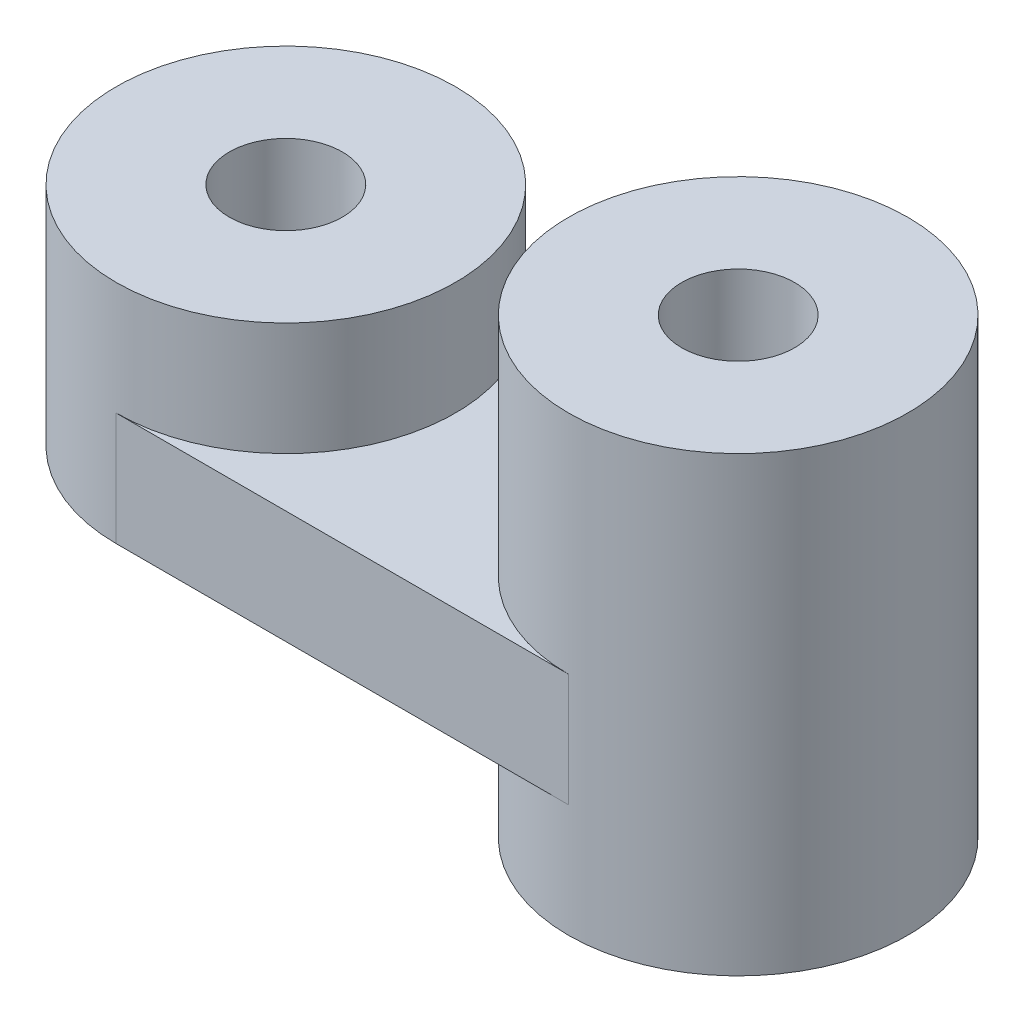
ISO-10303-21;
HEADER;
FILE_DESCRIPTION(('STEP AP214'),'2;1');
FILE_NAME('part.step','',(''),(''),'','','');
FILE_SCHEMA(('AUTOMOTIVE_DESIGN { 1 0 10303 214 1 1 1 1 }'));
ENDSEC;
DATA;
#1=APPLICATION_CONTEXT('core data for automotive mechanical design processes');
#2=APPLICATION_PROTOCOL_DEFINITION('international standard','automotive_design',2000,#1);
#3=PRODUCT_CONTEXT('',#1,'mechanical');
#4=PRODUCT('Part','Part','',(#3));
#5=PRODUCT_RELATED_PRODUCT_CATEGORY('part','',(#4));
#6=PRODUCT_DEFINITION_FORMATION('','',#4);
#7=PRODUCT_DEFINITION_CONTEXT('part definition',#1,'design');
#8=PRODUCT_DEFINITION('design','',#6,#7);
#9=PRODUCT_DEFINITION_SHAPE('','',#8);
#10=(LENGTH_UNIT() NAMED_UNIT(*) SI_UNIT(.MILLI.,.METRE.));
#11=(NAMED_UNIT(*) PLANE_ANGLE_UNIT() SI_UNIT($,.RADIAN.));
#12=(NAMED_UNIT(*) SI_UNIT($,.STERADIAN.) SOLID_ANGLE_UNIT());
#13=UNCERTAINTY_MEASURE_WITH_UNIT(LENGTH_MEASURE(1.E-05),#10,'distance_accuracy_value','');
#14=(GEOMETRIC_REPRESENTATION_CONTEXT(3) GLOBAL_UNCERTAINTY_ASSIGNED_CONTEXT((#13)) GLOBAL_UNIT_ASSIGNED_CONTEXT((#10,
#11,#12)) REPRESENTATION_CONTEXT('',''));
#15=CARTESIAN_POINT('',(0.,0.,0.));
#16=DIRECTION('',(0.,0.,1.));
#17=DIRECTION('',(1.,0.,0.));
#18=AXIS2_PLACEMENT_3D('',#15,#16,#17);
#19=CARTESIAN_POINT('',(-12.5,-5.,7.5));
#20=DIRECTION('',(0.,1.,0.));
#21=DIRECTION('',(0.,0.,1.));
#22=AXIS2_PLACEMENT_3D('',#19,#20,#21);
#23=CYLINDRICAL_SURFACE('',#22,2.5);
#24=CARTESIAN_POINT('',(-12.5,15.,7.5));
#25=DIRECTION('',(0.,1.,0.));
#26=DIRECTION('',(0.,0.,1.));
#27=AXIS2_PLACEMENT_3D('',#24,#25,#26);
#28=CIRCLE('',#27,2.5);
#29=CARTESIAN_POINT('',(-12.5,15.,10.));
#30=VERTEX_POINT('',#29);
#31=EDGE_CURVE('E206',#30,#30,#28,.T.);
#32=ORIENTED_EDGE('',*,*,#31,.T.);
#33=EDGE_LOOP('',(#32));
#34=FACE_BOUND('',#33,.T.);
#35=DIRECTION('',(0.,1.,0.));
#36=VECTOR('',#35,1.);
#37=CARTESIAN_POINT('',(-12.5,-5.,5.));
#38=LINE('',#37,#36);
#39=CARTESIAN_POINT('',(-12.5,10.,5.));
#40=VERTEX_POINT('',#39);
#41=CARTESIAN_POINT('',(-12.5,5.,5.));
#42=VERTEX_POINT('',#41);
#43=EDGE_CURVE('E81',#40,#42,#38,.F.);
#44=ORIENTED_EDGE('',*,*,#43,.F.);
#45=CARTESIAN_POINT('',(-12.5,10.,7.5));
#46=DIRECTION('',(0.,1.,0.));
#47=DIRECTION('',(0.,0.,1.));
#48=AXIS2_PLACEMENT_3D('',#45,#46,#47);
#49=CIRCLE('',#48,2.5);
#50=CARTESIAN_POINT('',(-12.5,10.,10.));
#51=VERTEX_POINT('',#50);
#52=EDGE_CURVE('E160',#40,#51,#49,.F.);
#53=ORIENTED_EDGE('',*,*,#52,.T.);
#54=DIRECTION('',(0.,1.,0.));
#55=VECTOR('',#54,1.);
#56=CARTESIAN_POINT('',(-12.5,-5.,10.));
#57=LINE('',#56,#55);
#58=CARTESIAN_POINT('',(-12.5,5.,10.));
#59=VERTEX_POINT('',#58);
#60=EDGE_CURVE('E89',#59,#51,#57,.T.);
#61=ORIENTED_EDGE('',*,*,#60,.F.);
#62=CARTESIAN_POINT('',(-12.5,5.,7.5));
#63=DIRECTION('',(0.,1.,0.));
#64=DIRECTION('',(0.,0.,1.));
#65=AXIS2_PLACEMENT_3D('',#62,#63,#64);
#66=CIRCLE('',#65,2.5);
#67=EDGE_CURVE('E213',#42,#59,#66,.T.);
#68=ORIENTED_EDGE('',*,*,#67,.F.);
#69=EDGE_LOOP('',(#44,#53,#61,#68));
#70=FACE_BOUND('',#69,.T.);
#71=ADVANCED_FACE('F65',(#34,#70),#23,.F.);
#72=CARTESIAN_POINT('',(7.5,0.,7.5));
#73=DIRECTION('',(0.,1.,0.));
#74=DIRECTION('',(0.,0.,1.));
#75=AXIS2_PLACEMENT_3D('',#72,#73,#74);
#76=CYLINDRICAL_SURFACE('',#75,2.5);
#77=CARTESIAN_POINT('',(7.5,20.,7.5));
#78=DIRECTION('',(0.,1.,0.));
#79=DIRECTION('',(0.,0.,1.));
#80=AXIS2_PLACEMENT_3D('',#77,#78,#79);
#81=CIRCLE('',#80,2.5);
#82=CARTESIAN_POINT('',(7.5,20.,10.));
#83=VERTEX_POINT('',#82);
#84=EDGE_CURVE('E159',#83,#83,#81,.T.);
#85=ORIENTED_EDGE('',*,*,#84,.T.);
#86=EDGE_LOOP('',(#85));
#87=FACE_BOUND('',#86,.T.);
#88=CARTESIAN_POINT('',(7.5,0.,7.5));
#89=DIRECTION('',(0.,1.,0.));
#90=DIRECTION('',(0.,0.,1.));
#91=AXIS2_PLACEMENT_3D('',#88,#89,#90);
#92=CIRCLE('',#91,2.5);
#93=CARTESIAN_POINT('',(7.5,0.,10.));
#94=VERTEX_POINT('',#93);
#95=EDGE_CURVE('E165',#94,#94,#92,.T.);
#96=ORIENTED_EDGE('',*,*,#95,.F.);
#97=EDGE_LOOP('',(#96));
#98=FACE_BOUND('',#97,.T.);
#99=DIRECTION('',(0.,1.,0.));
#100=VECTOR('',#99,1.);
#101=CARTESIAN_POINT('',(7.5,0.,10.));
#102=LINE('',#101,#100);
#103=CARTESIAN_POINT('',(7.5,5.,10.));
#104=VERTEX_POINT('',#103);
#105=CARTESIAN_POINT('',(7.5,10.,10.));
#106=VERTEX_POINT('',#105);
#107=EDGE_CURVE('E74',#104,#106,#102,.T.);
#108=ORIENTED_EDGE('',*,*,#107,.T.);
#109=CARTESIAN_POINT('',(7.5,10.,7.5));
#110=DIRECTION('',(0.,1.,0.));
#111=DIRECTION('',(0.,0.,1.));
#112=AXIS2_PLACEMENT_3D('',#109,#110,#111);
#113=CIRCLE('',#112,2.5);
#114=CARTESIAN_POINT('',(7.5,10.,5.));
#115=VERTEX_POINT('',#114);
#116=EDGE_CURVE('E167',#106,#115,#113,.F.);
#117=ORIENTED_EDGE('',*,*,#116,.T.);
#118=DIRECTION('',(0.,1.,0.));
#119=VECTOR('',#118,1.);
#120=CARTESIAN_POINT('',(7.5,0.,5.));
#121=LINE('',#120,#119);
#122=CARTESIAN_POINT('',(7.5,5.,5.));
#123=VERTEX_POINT('',#122);
#124=EDGE_CURVE('E228',#115,#123,#121,.F.);
#125=ORIENTED_EDGE('',*,*,#124,.T.);
#126=CARTESIAN_POINT('',(7.5,5.,7.5));
#127=DIRECTION('',(0.,1.,0.));
#128=DIRECTION('',(0.,0.,1.));
#129=AXIS2_PLACEMENT_3D('',#126,#127,#128);
#130=CIRCLE('',#129,2.5);
#131=EDGE_CURVE('E186',#123,#104,#130,.T.);
#132=ORIENTED_EDGE('',*,*,#131,.T.);
#133=EDGE_LOOP('',(#108,#117,#125,#132));
#134=FACE_BOUND('',#133,.T.);
#135=ADVANCED_FACE('F235',(#87,#98,#134),#76,.F.);
#136=CARTESIAN_POINT('',(7.5,20.,7.5));
#137=DIRECTION('',(0.,-1.,0.));
#138=DIRECTION('',(0.,0.,-1.));
#139=AXIS2_PLACEMENT_3D('',#136,#137,#138);
#140=CYLINDRICAL_SURFACE('',#139,7.5);
#141=CARTESIAN_POINT('',(7.5,0.,7.5));
#142=DIRECTION('',(0.,1.,0.));
#143=DIRECTION('',(0.,0.,1.));
#144=AXIS2_PLACEMENT_3D('',#141,#142,#143);
#145=CIRCLE('',#144,7.5);
#146=CARTESIAN_POINT('',(7.5,0.,15.));
#147=VERTEX_POINT('',#146);
#148=EDGE_CURVE('E173',#147,#147,#145,.T.);
#149=ORIENTED_EDGE('',*,*,#148,.T.);
#150=EDGE_LOOP('',(#149));
#151=FACE_BOUND('',#150,.T.);
#152=CARTESIAN_POINT('',(7.5,20.,7.5));
#153=DIRECTION('',(0.,1.,0.));
#154=DIRECTION('',(0.,0.,1.));
#155=AXIS2_PLACEMENT_3D('',#152,#153,#154);
#156=CIRCLE('',#155,7.5);
#157=CARTESIAN_POINT('',(7.5,20.,15.));
#158=VERTEX_POINT('',#157);
#159=EDGE_CURVE('E175',#158,#158,#156,.T.);
#160=ORIENTED_EDGE('',*,*,#159,.F.);
#161=EDGE_LOOP('',(#160));
#162=FACE_BOUND('',#161,.T.);
#163=DIRECTION('',(0.,-1.,0.));
#164=VECTOR('',#163,1.);
#165=CARTESIAN_POINT('',(7.5,7.5,0.));
#166=LINE('',#165,#164);
#167=CARTESIAN_POINT('',(7.5,10.,0.));
#168=VERTEX_POINT('',#167);
#169=CARTESIAN_POINT('',(7.5,5.,0.));
#170=VERTEX_POINT('',#169);
#171=EDGE_CURVE('E143',#168,#170,#166,.T.);
#172=ORIENTED_EDGE('',*,*,#171,.F.);
#173=CARTESIAN_POINT('',(7.5,10.,7.5));
#174=DIRECTION('',(0.,1.,0.));
#175=DIRECTION('',(0.,0.,1.));
#176=AXIS2_PLACEMENT_3D('',#173,#174,#175);
#177=CIRCLE('',#176,7.5);
#178=CARTESIAN_POINT('',(7.5,10.,15.));
#179=VERTEX_POINT('',#178);
#180=EDGE_CURVE('E12',#168,#179,#177,.T.);
#181=ORIENTED_EDGE('',*,*,#180,.T.);
#182=DIRECTION('',(0.,-1.,0.));
#183=VECTOR('',#182,1.);
#184=CARTESIAN_POINT('',(7.5,7.5,15.));
#185=LINE('',#184,#183);
#186=CARTESIAN_POINT('',(7.5,5.,15.));
#187=VERTEX_POINT('',#186);
#188=EDGE_CURVE('E197',#179,#187,#185,.T.);
#189=ORIENTED_EDGE('',*,*,#188,.T.);
#190=CARTESIAN_POINT('',(7.5,5.,7.5));
#191=DIRECTION('',(0.,1.,0.));
#192=DIRECTION('',(0.,0.,1.));
#193=AXIS2_PLACEMENT_3D('',#190,#191,#192);
#194=CIRCLE('',#193,7.5);
#195=EDGE_CURVE('E179',#187,#170,#194,.F.);
#196=ORIENTED_EDGE('',*,*,#195,.T.);
#197=EDGE_LOOP('',(#172,#181,#189,#196));
#198=FACE_BOUND('',#197,.T.);
#199=ADVANCED_FACE('F256',(#151,#162,#198),#140,.T.);
#200=CARTESIAN_POINT('',(-20.,5.,-5.));
#201=DIRECTION('',(0.,1.,0.));
#202=DIRECTION('',(0.,0.,1.));
#203=AXIS2_PLACEMENT_3D('',#200,#201,#202);
#204=PLANE('',#203);
#205=ORIENTED_EDGE('',*,*,#67,.T.);
#206=DIRECTION('',(0.,0.,1.));
#207=VECTOR('',#206,1.);
#208=CARTESIAN_POINT('',(-12.5,5.,0.));
#209=LINE('',#208,#207);
#210=EDGE_CURVE('E203',#42,#59,#209,.T.);
#211=ORIENTED_EDGE('',*,*,#210,.F.);
#212=EDGE_LOOP('',(#205,#211));
#213=FACE_BOUND('',#212,.T.);
#214=ORIENTED_EDGE('',*,*,#195,.F.);
#215=DIRECTION('',(1.,0.,0.));
#216=VECTOR('',#215,1.);
#217=CARTESIAN_POINT('',(-12.5,5.,15.));
#218=LINE('',#217,#216);
#219=CARTESIAN_POINT('',(-12.5,5.,15.));
#220=VERTEX_POINT('',#219);
#221=EDGE_CURVE('E190',#220,#187,#218,.T.);
#222=ORIENTED_EDGE('',*,*,#221,.F.);
#223=CARTESIAN_POINT('',(-12.5,5.,7.5));
#224=DIRECTION('',(0.,1.,0.));
#225=DIRECTION('',(0.,0.,1.));
#226=AXIS2_PLACEMENT_3D('',#223,#224,#225);
#227=CIRCLE('',#226,7.5);
#228=CARTESIAN_POINT('',(-12.5,5.,0.));
#229=VERTEX_POINT('',#228);
#230=EDGE_CURVE('E217',#229,#220,#227,.T.);
#231=ORIENTED_EDGE('',*,*,#230,.F.);
#232=DIRECTION('',(1.,0.,0.));
#233=VECTOR('',#232,1.);
#234=CARTESIAN_POINT('',(-12.5,5.,0.));
#235=LINE('',#234,#233);
#236=EDGE_CURVE('E137',#229,#170,#235,.T.);
#237=ORIENTED_EDGE('',*,*,#236,.T.);
#238=EDGE_LOOP('',(#214,#222,#231,#237));
#239=FACE_BOUND('',#238,.T.);
#240=ADVANCED_FACE('F259',(#213,#239),#204,.F.);
#241=CARTESIAN_POINT('',(-12.5,20.,7.5));
#242=DIRECTION('',(0.,-1.,0.));
#243=DIRECTION('',(0.,0.,-1.));
#244=AXIS2_PLACEMENT_3D('',#241,#242,#243);
#245=CYLINDRICAL_SURFACE('',#244,7.5);
#246=CARTESIAN_POINT('',(-12.5,15.,7.5));
#247=DIRECTION('',(0.,-1.,0.));
#248=DIRECTION('',(0.,0.,-1.));
#249=AXIS2_PLACEMENT_3D('',#246,#247,#248);
#250=CIRCLE('',#249,7.5);
#251=CARTESIAN_POINT('',(-12.5,15.,0.));
#252=VERTEX_POINT('',#251);
#253=EDGE_CURVE('E220',#252,#252,#250,.T.);
#254=ORIENTED_EDGE('',*,*,#253,.T.);
#255=EDGE_LOOP('',(#254));
#256=FACE_BOUND('',#255,.T.);
#257=CARTESIAN_POINT('',(-12.5,10.,7.5));
#258=DIRECTION('',(0.,1.,0.));
#259=DIRECTION('',(0.,0.,1.));
#260=AXIS2_PLACEMENT_3D('',#257,#258,#259);
#261=CIRCLE('',#260,7.5);
#262=CARTESIAN_POINT('',(-12.5,10.,15.));
#263=VERTEX_POINT('',#262);
#264=CARTESIAN_POINT('',(-12.5,10.,0.));
#265=VERTEX_POINT('',#264);
#266=EDGE_CURVE('E150',#263,#265,#261,.T.);
#267=ORIENTED_EDGE('',*,*,#266,.T.);
#268=DIRECTION('',(0.,1.,0.));
#269=VECTOR('',#268,1.);
#270=CARTESIAN_POINT('',(-12.5,5.,0.));
#271=LINE('',#270,#269);
#272=EDGE_CURVE('E132',#229,#265,#271,.T.);
#273=ORIENTED_EDGE('',*,*,#272,.F.);
#274=ORIENTED_EDGE('',*,*,#230,.T.);
#275=DIRECTION('',(0.,1.,0.));
#276=VECTOR('',#275,1.);
#277=CARTESIAN_POINT('',(-12.5,5.,15.));
#278=LINE('',#277,#276);
#279=EDGE_CURVE('E157',#220,#263,#278,.T.);
#280=ORIENTED_EDGE('',*,*,#279,.T.);
#281=EDGE_LOOP('',(#267,#273,#274,#280));
#282=FACE_BOUND('',#281,.T.);
#283=ADVANCED_FACE('F67',(#256,#282),#245,.T.);
#284=CARTESIAN_POINT('',(-20.,15.,-5.));
#285=DIRECTION('',(0.,-1.,0.));
#286=DIRECTION('',(0.,0.,-1.));
#287=AXIS2_PLACEMENT_3D('',#284,#285,#286);
#288=PLANE('',#287);
#289=ORIENTED_EDGE('',*,*,#31,.F.);
#290=EDGE_LOOP('',(#289));
#291=FACE_BOUND('',#290,.T.);
#292=ORIENTED_EDGE('',*,*,#253,.F.);
#293=EDGE_LOOP('',(#292));
#294=FACE_BOUND('',#293,.T.);
#295=ADVANCED_FACE('F267',(#291,#294),#288,.F.);
#296=CARTESIAN_POINT('',(-12.5,5.,0.));
#297=DIRECTION('',(1.,0.,0.));
#298=DIRECTION('',(0.,0.,-1.));
#299=AXIS2_PLACEMENT_3D('',#296,#297,#298);
#300=PLANE('',#299);
#301=ORIENTED_EDGE('',*,*,#60,.T.);
#302=DIRECTION('',(0.,0.,1.));
#303=VECTOR('',#302,1.);
#304=CARTESIAN_POINT('',(-12.5,10.,0.));
#305=LINE('',#304,#303);
#306=EDGE_CURVE('E153',#40,#51,#305,.T.);
#307=ORIENTED_EDGE('',*,*,#306,.F.);
#308=ORIENTED_EDGE('',*,*,#43,.T.);
#309=ORIENTED_EDGE('',*,*,#210,.T.);
#310=EDGE_LOOP('',(#301,#307,#308,#309));
#311=FACE_BOUND('',#310,.T.);
#312=ADVANCED_FACE('F285',(#311),#300,.F.);
#313=CARTESIAN_POINT('',(0.,0.,0.));
#314=DIRECTION('',(0.,0.,-1.));
#315=DIRECTION('',(-1.,0.,0.));
#316=AXIS2_PLACEMENT_3D('',#313,#314,#315);
#317=PLANE('',#316);
#318=ORIENTED_EDGE('',*,*,#236,.F.);
#319=ORIENTED_EDGE('',*,*,#272,.T.);
#320=DIRECTION('',(-1.,0.,0.));
#321=VECTOR('',#320,1.);
#322=CARTESIAN_POINT('',(7.5,10.,0.));
#323=LINE('',#322,#321);
#324=EDGE_CURVE('E135',#168,#265,#323,.T.);
#325=ORIENTED_EDGE('',*,*,#324,.F.);
#326=ORIENTED_EDGE('',*,*,#171,.T.);
#327=EDGE_LOOP('',(#318,#319,#325,#326));
#328=FACE_BOUND('',#327,.T.);
#329=ADVANCED_FACE('F134',(#328),#317,.T.);
#330=CARTESIAN_POINT('',(0.,0.,15.));
#331=DIRECTION('',(0.,0.,-1.));
#332=DIRECTION('',(-1.,0.,0.));
#333=AXIS2_PLACEMENT_3D('',#330,#331,#332);
#334=PLANE('',#333);
#335=ORIENTED_EDGE('',*,*,#221,.T.);
#336=ORIENTED_EDGE('',*,*,#188,.F.);
#337=DIRECTION('',(-1.,0.,0.));
#338=VECTOR('',#337,1.);
#339=CARTESIAN_POINT('',(7.5,10.,15.));
#340=LINE('',#339,#338);
#341=EDGE_CURVE('E154',#179,#263,#340,.T.);
#342=ORIENTED_EDGE('',*,*,#341,.T.);
#343=ORIENTED_EDGE('',*,*,#279,.F.);
#344=EDGE_LOOP('',(#335,#336,#342,#343));
#345=FACE_BOUND('',#344,.T.);
#346=ADVANCED_FACE('F253',(#345),#334,.F.);
#347=CARTESIAN_POINT('',(0.,20.,0.));
#348=DIRECTION('',(0.,1.,0.));
#349=DIRECTION('',(0.,0.,1.));
#350=AXIS2_PLACEMENT_3D('',#347,#348,#349);
#351=PLANE('',#350);
#352=ORIENTED_EDGE('',*,*,#84,.F.);
#353=EDGE_LOOP('',(#352));
#354=FACE_BOUND('',#353,.T.);
#355=ORIENTED_EDGE('',*,*,#159,.T.);
#356=EDGE_LOOP('',(#355));
#357=FACE_BOUND('',#356,.T.);
#358=ADVANCED_FACE('F299',(#354,#357),#351,.T.);
#359=CARTESIAN_POINT('',(0.,0.,0.));
#360=DIRECTION('',(0.,1.,0.));
#361=DIRECTION('',(0.,0.,1.));
#362=AXIS2_PLACEMENT_3D('',#359,#360,#361);
#363=PLANE('',#362);
#364=ORIENTED_EDGE('',*,*,#95,.T.);
#365=EDGE_LOOP('',(#364));
#366=FACE_BOUND('',#365,.T.);
#367=ORIENTED_EDGE('',*,*,#148,.F.);
#368=EDGE_LOOP('',(#367));
#369=FACE_BOUND('',#368,.T.);
#370=ADVANCED_FACE('F301',(#366,#369),#363,.F.);
#371=CARTESIAN_POINT('',(7.5,7.5,0.));
#372=DIRECTION('',(-1.,0.,0.));
#373=DIRECTION('',(0.,0.,1.));
#374=AXIS2_PLACEMENT_3D('',#371,#372,#373);
#375=PLANE('',#374);
#376=ORIENTED_EDGE('',*,*,#107,.F.);
#377=DIRECTION('',(0.,0.,1.));
#378=VECTOR('',#377,1.);
#379=CARTESIAN_POINT('',(7.5,5.,0.));
#380=LINE('',#379,#378);
#381=EDGE_CURVE('E142',#123,#104,#380,.T.);
#382=ORIENTED_EDGE('',*,*,#381,.F.);
#383=ORIENTED_EDGE('',*,*,#124,.F.);
#384=DIRECTION('',(0.,0.,1.));
#385=VECTOR('',#384,1.);
#386=CARTESIAN_POINT('',(7.5,10.,0.));
#387=LINE('',#386,#385);
#388=EDGE_CURVE('E242',#115,#106,#387,.T.);
#389=ORIENTED_EDGE('',*,*,#388,.T.);
#390=EDGE_LOOP('',(#376,#382,#383,#389));
#391=FACE_BOUND('',#390,.T.);
#392=ADVANCED_FACE('F244',(#391),#375,.F.);
#393=ORIENTED_EDGE('',*,*,#131,.F.);
#394=ORIENTED_EDGE('',*,*,#381,.T.);
#395=EDGE_LOOP('',(#393,#394));
#396=FACE_BOUND('',#395,.T.);
#397=ADVANCED_FACE('F262',(#396),#204,.F.);
#398=CARTESIAN_POINT('',(7.5,10.,0.));
#399=DIRECTION('',(0.,1.,0.));
#400=DIRECTION('',(0.,0.,1.));
#401=AXIS2_PLACEMENT_3D('',#398,#399,#400);
#402=PLANE('',#401);
#403=ORIENTED_EDGE('',*,*,#116,.F.);
#404=ORIENTED_EDGE('',*,*,#388,.F.);
#405=EDGE_LOOP('',(#403,#404));
#406=FACE_BOUND('',#405,.T.);
#407=ADVANCED_FACE('F241',(#406),#402,.T.);
#408=ORIENTED_EDGE('',*,*,#266,.F.);
#409=ORIENTED_EDGE('',*,*,#341,.F.);
#410=ORIENTED_EDGE('',*,*,#180,.F.);
#411=ORIENTED_EDGE('',*,*,#324,.T.);
#412=EDGE_LOOP('',(#408,#409,#410,#411));
#413=FACE_BOUND('',#412,.T.);
#414=ADVANCED_FACE('F148',(#413),#402,.T.);
#415=ORIENTED_EDGE('',*,*,#52,.F.);
#416=ORIENTED_EDGE('',*,*,#306,.T.);
#417=EDGE_LOOP('',(#415,#416));
#418=FACE_BOUND('',#417,.T.);
#419=ADVANCED_FACE('F308',(#418),#402,.T.);
#420=CLOSED_SHELL('',(#71,#135,#199,#240,#283,#295,#312,#329,#346,#358,#370,#392,#397,#407,#414,#419));
#421=MANIFOLD_SOLID_BREP('B2',#420);
#422=ADVANCED_BREP_SHAPE_REPRESENTATION('',(#18,#421),#14);
#423=SHAPE_DEFINITION_REPRESENTATION(#9,#422);
ENDSEC;
END-ISO-10303-21;
